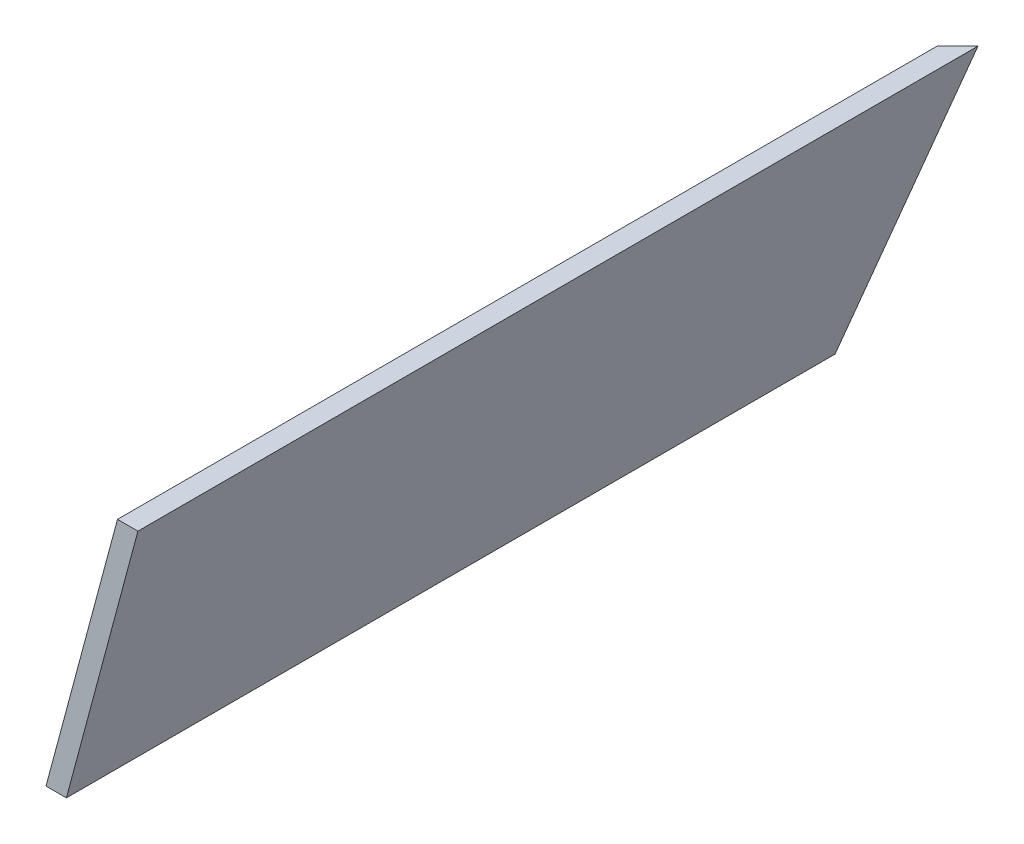
ISO-10303-21;
HEADER;
FILE_DESCRIPTION(('STEP AP214'),'2;1');
FILE_NAME('part.step','',(''),(''),'','','');
FILE_SCHEMA(('AUTOMOTIVE_DESIGN { 1 0 10303 214 1 1 1 1 }'));
ENDSEC;
DATA;
#1=APPLICATION_CONTEXT('core data for automotive mechanical design processes');
#2=APPLICATION_PROTOCOL_DEFINITION('international standard','automotive_design',2000,#1);
#3=PRODUCT_CONTEXT('',#1,'mechanical');
#4=PRODUCT('Part','Part','',(#3));
#5=PRODUCT_RELATED_PRODUCT_CATEGORY('part','',(#4));
#6=PRODUCT_DEFINITION_FORMATION('','',#4);
#7=PRODUCT_DEFINITION_CONTEXT('part definition',#1,'design');
#8=PRODUCT_DEFINITION('design','',#6,#7);
#9=PRODUCT_DEFINITION_SHAPE('','',#8);
#10=(LENGTH_UNIT() NAMED_UNIT(*) SI_UNIT(.MILLI.,.METRE.));
#11=(NAMED_UNIT(*) PLANE_ANGLE_UNIT() SI_UNIT($,.RADIAN.));
#12=(NAMED_UNIT(*) SI_UNIT($,.STERADIAN.) SOLID_ANGLE_UNIT());
#13=UNCERTAINTY_MEASURE_WITH_UNIT(LENGTH_MEASURE(1.E-05),#10,'distance_accuracy_value','');
#14=(GEOMETRIC_REPRESENTATION_CONTEXT(3) GLOBAL_UNCERTAINTY_ASSIGNED_CONTEXT((#13)) GLOBAL_UNIT_ASSIGNED_CONTEXT((#10,
#11,#12)) REPRESENTATION_CONTEXT('',''));
#15=CARTESIAN_POINT('',(0.,0.,0.));
#16=DIRECTION('',(0.,0.,1.));
#17=DIRECTION('',(1.,0.,0.));
#18=AXIS2_PLACEMENT_3D('',#15,#16,#17);
#19=CARTESIAN_POINT('',(527.712818728019,171.741611914197,-730.545693715292));
#20=DIRECTION('',(-0.96592582628907,0.258819045102514,0.));
#21=DIRECTION('',(-0.258819045102514,-0.96592582628907,0.));
#22=AXIS2_PLACEMENT_3D('',#19,#20,#21);
#23=PLANE('',#22);
#24=DIRECTION('',(0.250562807085726,0.935113126531033,-0.250562807085726));
#25=VECTOR('',#24,1.);
#26=CARTESIAN_POINT('',(540.447015552035,219.26628145501,-540.447015552035));
#27=LINE('',#26,#25);
#28=CARTESIAN_POINT('',(481.694792508792,0.,-481.694792508792));
#29=VERTEX_POINT('',#28);
#30=CARTESIAN_POINT('',(527.712818728019,171.741611914197,-527.712818728019));
#31=VERTEX_POINT('',#30);
#32=EDGE_CURVE('E48',#29,#31,#27,.T.);
#33=ORIENTED_EDGE('',*,*,#32,.F.);
#34=DIRECTION('',(0.,0.,1.));
#35=VECTOR('',#34,1.);
#36=CARTESIAN_POINT('',(481.694792508792,0.,-730.545693715292));
#37=LINE('',#36,#35);
#38=CARTESIAN_POINT('',(481.694792508792,0.,0.));
#39=VERTEX_POINT('',#38);
#40=EDGE_CURVE('E76',#29,#39,#37,.T.);
#41=ORIENTED_EDGE('',*,*,#40,.T.);
#42=DIRECTION('',(-0.258819045102514,-0.96592582628907,0.));
#43=VECTOR('',#42,1.);
#44=CARTESIAN_POINT('',(527.712818728019,171.741611914197,0.));
#45=LINE('',#44,#43);
#46=CARTESIAN_POINT('',(527.712818728019,171.741611914197,0.));
#47=VERTEX_POINT('',#46);
#48=EDGE_CURVE('E80',#47,#39,#45,.T.);
#49=ORIENTED_EDGE('',*,*,#48,.F.);
#50=DIRECTION('',(0.,0.,1.));
#51=VECTOR('',#50,1.);
#52=CARTESIAN_POINT('',(527.712818728019,171.741611914197,-730.545693715292));
#53=LINE('',#52,#51);
#54=EDGE_CURVE('E108',#31,#47,#53,.T.);
#55=ORIENTED_EDGE('',*,*,#54,.F.);
#56=EDGE_LOOP('',(#33,#41,#49,#55));
#57=FACE_BOUND('',#56,.T.);
#58=ADVANCED_FACE('F39',(#57),#23,.T.);
#59=CARTESIAN_POINT('',(540.860826219227,171.741611914197,-730.545693715292));
#60=DIRECTION('',(0.,1.,0.));
#61=DIRECTION('',(0.,0.,1.));
#62=AXIS2_PLACEMENT_3D('',#59,#60,#61);
#63=PLANE('',#62);
#64=DIRECTION('',(0.707106781186548,0.,-0.707106781186548));
#65=VECTOR('',#64,1.);
#66=CARTESIAN_POINT('',(635.70325996726,171.741611914197,-635.70325996726));
#67=LINE('',#66,#65);
#68=CARTESIAN_POINT('',(540.860826219227,171.741611914197,-540.860826219227));
#69=VERTEX_POINT('',#68);
#70=EDGE_CURVE('E54',#31,#69,#67,.T.);
#71=ORIENTED_EDGE('',*,*,#70,.F.);
#72=ORIENTED_EDGE('',*,*,#54,.T.);
#73=DIRECTION('',(-1.,0.,0.));
#74=VECTOR('',#73,1.);
#75=CARTESIAN_POINT('',(540.860826219227,171.741611914197,0.));
#76=LINE('',#75,#74);
#77=CARTESIAN_POINT('',(540.860826219227,171.741611914197,0.));
#78=VERTEX_POINT('',#77);
#79=EDGE_CURVE('E86',#78,#47,#76,.T.);
#80=ORIENTED_EDGE('',*,*,#79,.F.);
#81=DIRECTION('',(0.,0.,1.));
#82=VECTOR('',#81,1.);
#83=CARTESIAN_POINT('',(540.860826219227,171.741611914197,-730.545693715292));
#84=LINE('',#83,#82);
#85=EDGE_CURVE('E112',#69,#78,#84,.T.);
#86=ORIENTED_EDGE('',*,*,#85,.F.);
#87=EDGE_LOOP('',(#71,#72,#80,#86));
#88=FACE_BOUND('',#87,.T.);
#89=ADVANCED_FACE('F123',(#88),#63,.T.);
#90=CARTESIAN_POINT('',(494.8428,0.,-730.545693715292));
#91=DIRECTION('',(0.96592582628907,-0.258819045102514,0.));
#92=DIRECTION('',(0.258819045102514,0.96592582628907,0.));
#93=AXIS2_PLACEMENT_3D('',#90,#91,#92);
#94=PLANE('',#93);
#95=DIRECTION('',(-0.250562807085725,-0.935113126531033,0.250562807085725));
#96=VECTOR('',#95,1.);
#97=CARTESIAN_POINT('',(509.64063314588,55.2262651423518,-509.64063314588));
#98=LINE('',#97,#96);
#99=CARTESIAN_POINT('',(494.8428,0.,-494.8428));
#100=VERTEX_POINT('',#99);
#101=EDGE_CURVE('E111',#69,#100,#98,.T.);
#102=ORIENTED_EDGE('',*,*,#101,.F.);
#103=ORIENTED_EDGE('',*,*,#85,.T.);
#104=DIRECTION('',(0.258819045102514,0.96592582628907,0.));
#105=VECTOR('',#104,1.);
#106=CARTESIAN_POINT('',(494.8428,0.,0.));
#107=LINE('',#106,#105);
#108=CARTESIAN_POINT('',(494.8428,0.,0.));
#109=VERTEX_POINT('',#108);
#110=EDGE_CURVE('E95',#109,#78,#107,.T.);
#111=ORIENTED_EDGE('',*,*,#110,.F.);
#112=DIRECTION('',(0.,0.,1.));
#113=VECTOR('',#112,1.);
#114=CARTESIAN_POINT('',(494.8428,0.,-730.545693715292));
#115=LINE('',#114,#113);
#116=EDGE_CURVE('E85',#100,#109,#115,.T.);
#117=ORIENTED_EDGE('',*,*,#116,.F.);
#118=EDGE_LOOP('',(#102,#103,#111,#117));
#119=FACE_BOUND('',#118,.T.);
#120=ADVANCED_FACE('F125',(#119),#94,.T.);
#121=CARTESIAN_POINT('',(481.694792508792,0.,-730.545693715292));
#122=DIRECTION('',(0.,-1.,0.));
#123=DIRECTION('',(0.,0.,-1.));
#124=AXIS2_PLACEMENT_3D('',#121,#122,#123);
#125=PLANE('',#124);
#126=DIRECTION('',(-0.707106781186548,0.,0.707106781186548));
#127=VECTOR('',#126,1.);
#128=CARTESIAN_POINT('',(606.120243112042,0.,-606.120243112042));
#129=LINE('',#128,#127);
#130=EDGE_CURVE('E11',#100,#29,#129,.T.);
#131=ORIENTED_EDGE('',*,*,#130,.F.);
#132=ORIENTED_EDGE('',*,*,#116,.T.);
#133=DIRECTION('',(1.,0.,0.));
#134=VECTOR('',#133,1.);
#135=CARTESIAN_POINT('',(481.694792508792,0.,0.));
#136=LINE('',#135,#134);
#137=EDGE_CURVE('E88',#39,#109,#136,.T.);
#138=ORIENTED_EDGE('',*,*,#137,.F.);
#139=ORIENTED_EDGE('',*,*,#40,.F.);
#140=EDGE_LOOP('',(#131,#132,#138,#139));
#141=FACE_BOUND('',#140,.T.);
#142=ADVANCED_FACE('F89',(#141),#125,.T.);
#143=CARTESIAN_POINT('',(0.,0.,0.));
#144=DIRECTION('',(0.,0.,1.));
#145=DIRECTION('',(1.,0.,0.));
#146=AXIS2_PLACEMENT_3D('',#143,#144,#145);
#147=PLANE('',#146);
#148=ORIENTED_EDGE('',*,*,#48,.T.);
#149=ORIENTED_EDGE('',*,*,#137,.T.);
#150=ORIENTED_EDGE('',*,*,#110,.T.);
#151=ORIENTED_EDGE('',*,*,#79,.T.);
#152=EDGE_LOOP('',(#148,#149,#150,#151));
#153=FACE_BOUND('',#152,.T.);
#154=ADVANCED_FACE('F97',(#153),#147,.T.);
#155=CARTESIAN_POINT('',(0.,0.,0.));
#156=DIRECTION('',(0.707106781186548,0.,0.707106781186548));
#157=DIRECTION('',(0.707106781186548,0.,-0.707106781186548));
#158=AXIS2_PLACEMENT_3D('',#155,#156,#157);
#159=PLANE('',#158);
#160=ORIENTED_EDGE('',*,*,#32,.T.);
#161=ORIENTED_EDGE('',*,*,#70,.T.);
#162=ORIENTED_EDGE('',*,*,#101,.T.);
#163=ORIENTED_EDGE('',*,*,#130,.T.);
#164=EDGE_LOOP('',(#160,#161,#162,#163));
#165=FACE_BOUND('',#164,.T.);
#166=ADVANCED_FACE('F120',(#165),#159,.F.);
#167=CLOSED_SHELL('',(#58,#89,#120,#142,#154,#166));
#168=MANIFOLD_SOLID_BREP('B2',#167);
#169=ADVANCED_BREP_SHAPE_REPRESENTATION('',(#18,#168),#14);
#170=SHAPE_DEFINITION_REPRESENTATION(#9,#169);
ENDSEC;
END-ISO-10303-21;
